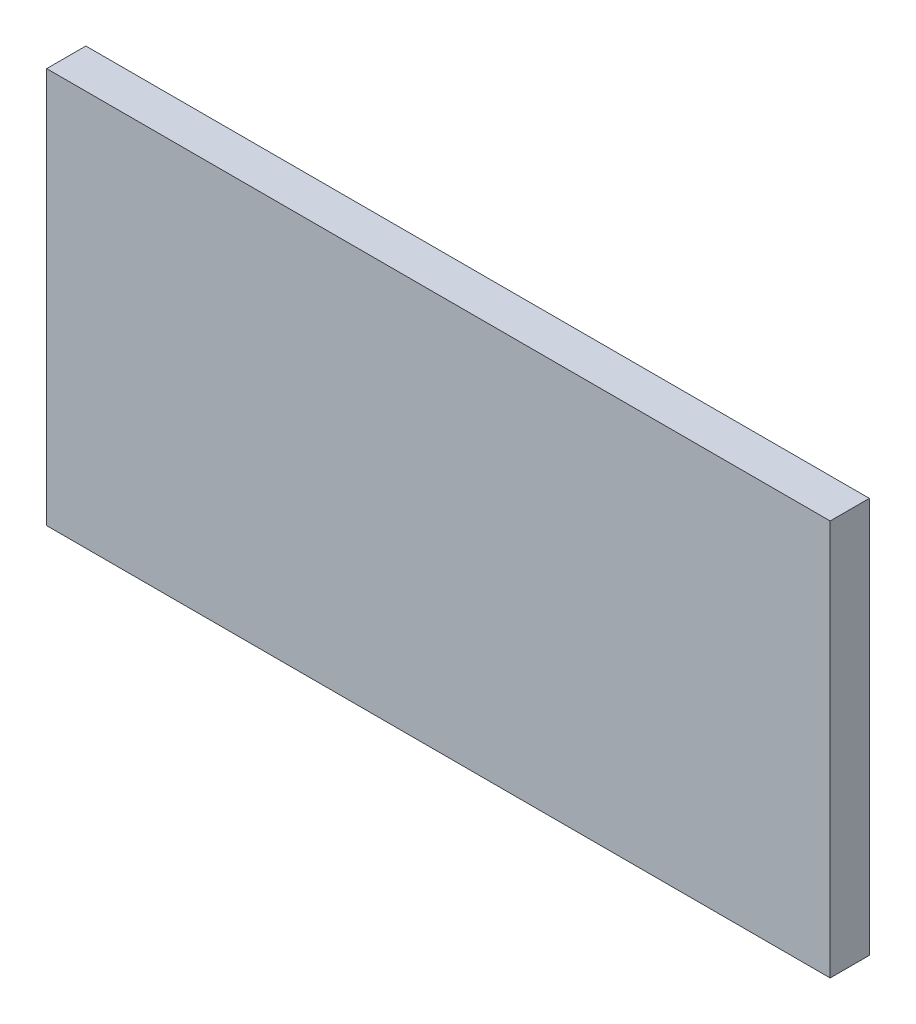
ISO-10303-21;
HEADER;
FILE_DESCRIPTION(('STEP AP214'),'2;1');
FILE_NAME('part.step','',(''),(''),'','','');
FILE_SCHEMA(('AUTOMOTIVE_DESIGN { 1 0 10303 214 1 1 1 1 }'));
ENDSEC;
DATA;
#1=APPLICATION_CONTEXT('core data for automotive mechanical design processes');
#2=APPLICATION_PROTOCOL_DEFINITION('international standard','automotive_design',2000,#1);
#3=PRODUCT_CONTEXT('',#1,'mechanical');
#4=PRODUCT('Part','Part','',(#3));
#5=PRODUCT_RELATED_PRODUCT_CATEGORY('part','',(#4));
#6=PRODUCT_DEFINITION_FORMATION('','',#4);
#7=PRODUCT_DEFINITION_CONTEXT('part definition',#1,'design');
#8=PRODUCT_DEFINITION('design','',#6,#7);
#9=PRODUCT_DEFINITION_SHAPE('','',#8);
#10=(LENGTH_UNIT() NAMED_UNIT(*) SI_UNIT(.MILLI.,.METRE.));
#11=(NAMED_UNIT(*) PLANE_ANGLE_UNIT() SI_UNIT($,.RADIAN.));
#12=(NAMED_UNIT(*) SI_UNIT($,.STERADIAN.) SOLID_ANGLE_UNIT());
#13=UNCERTAINTY_MEASURE_WITH_UNIT(LENGTH_MEASURE(1.E-05),#10,'distance_accuracy_value','');
#14=(GEOMETRIC_REPRESENTATION_CONTEXT(3) GLOBAL_UNCERTAINTY_ASSIGNED_CONTEXT((#13)) GLOBAL_UNIT_ASSIGNED_CONTEXT((#10,
#11,#12)) REPRESENTATION_CONTEXT('',''));
#15=CARTESIAN_POINT('',(0.,0.,0.));
#16=DIRECTION('',(0.,0.,1.));
#17=DIRECTION('',(1.,0.,0.));
#18=AXIS2_PLACEMENT_3D('',#15,#16,#17);
#19=CARTESIAN_POINT('',(-240.,0.,0.));
#20=DIRECTION('',(0.,0.,1.));
#21=DIRECTION('',(0.,-1.,0.));
#22=AXIS2_PLACEMENT_3D('',#19,#20,#21);
#23=PLANE('',#22);
#24=DIRECTION('',(0.,-1.,0.));
#25=VECTOR('',#24,1.);
#26=CARTESIAN_POINT('',(0.,0.,0.));
#27=LINE('',#26,#25);
#28=CARTESIAN_POINT('',(0.,0.,0.));
#29=VERTEX_POINT('',#28);
#30=CARTESIAN_POINT('',(0.,-121.24,0.));
#31=VERTEX_POINT('',#30);
#32=EDGE_CURVE('E97',#29,#31,#27,.T.);
#33=ORIENTED_EDGE('',*,*,#32,.F.);
#34=DIRECTION('',(1.,0.,0.));
#35=VECTOR('',#34,1.);
#36=CARTESIAN_POINT('',(-240.,0.,0.));
#37=LINE('',#36,#35);
#38=CARTESIAN_POINT('',(-240.,0.,0.));
#39=VERTEX_POINT('',#38);
#40=EDGE_CURVE('E11',#39,#29,#37,.T.);
#41=ORIENTED_EDGE('',*,*,#40,.F.);
#42=DIRECTION('',(0.,-1.,0.));
#43=VECTOR('',#42,1.);
#44=CARTESIAN_POINT('',(-240.,0.,0.));
#45=LINE('',#44,#43);
#46=CARTESIAN_POINT('',(-240.,-121.24,0.));
#47=VERTEX_POINT('',#46);
#48=EDGE_CURVE('E91',#39,#47,#45,.T.);
#49=ORIENTED_EDGE('',*,*,#48,.T.);
#50=DIRECTION('',(1.,0.,0.));
#51=VECTOR('',#50,1.);
#52=CARTESIAN_POINT('',(-240.,-121.24,0.));
#53=LINE('',#52,#51);
#54=EDGE_CURVE('E36',#47,#31,#53,.T.);
#55=ORIENTED_EDGE('',*,*,#54,.T.);
#56=EDGE_LOOP('',(#33,#41,#49,#55));
#57=FACE_BOUND('',#56,.T.);
#58=ADVANCED_FACE('F33',(#57),#23,.T.);
#59=CARTESIAN_POINT('',(-240.,0.,0.));
#60=DIRECTION('',(0.,1.,0.));
#61=DIRECTION('',(0.,0.,1.));
#62=AXIS2_PLACEMENT_3D('',#59,#60,#61);
#63=PLANE('',#62);
#64=DIRECTION('',(0.,0.,1.));
#65=VECTOR('',#64,1.);
#66=CARTESIAN_POINT('',(0.,0.,0.));
#67=LINE('',#66,#65);
#68=CARTESIAN_POINT('',(0.,0.,-12.));
#69=VERTEX_POINT('',#68);
#70=EDGE_CURVE('E93',#69,#29,#67,.T.);
#71=ORIENTED_EDGE('',*,*,#70,.F.);
#72=DIRECTION('',(1.,0.,0.));
#73=VECTOR('',#72,1.);
#74=CARTESIAN_POINT('',(-240.,0.,-12.));
#75=LINE('',#74,#73);
#76=CARTESIAN_POINT('',(-240.,0.,-12.));
#77=VERTEX_POINT('',#76);
#78=EDGE_CURVE('E42',#77,#69,#75,.T.);
#79=ORIENTED_EDGE('',*,*,#78,.F.);
#80=DIRECTION('',(0.,0.,1.));
#81=VECTOR('',#80,1.);
#82=CARTESIAN_POINT('',(-240.,0.,0.));
#83=LINE('',#82,#81);
#84=EDGE_CURVE('E88',#77,#39,#83,.T.);
#85=ORIENTED_EDGE('',*,*,#84,.T.);
#86=ORIENTED_EDGE('',*,*,#40,.T.);
#87=EDGE_LOOP('',(#71,#79,#85,#86));
#88=FACE_BOUND('',#87,.T.);
#89=ADVANCED_FACE('F107',(#88),#63,.T.);
#90=CARTESIAN_POINT('',(-240.,0.,-12.));
#91=DIRECTION('',(0.,0.,-1.));
#92=DIRECTION('',(0.,1.,0.));
#93=AXIS2_PLACEMENT_3D('',#90,#91,#92);
#94=PLANE('',#93);
#95=DIRECTION('',(0.,1.,0.));
#96=VECTOR('',#95,1.);
#97=CARTESIAN_POINT('',(0.,0.,-12.));
#98=LINE('',#97,#96);
#99=CARTESIAN_POINT('',(0.,-121.24,-12.));
#100=VERTEX_POINT('',#99);
#101=EDGE_CURVE('E83',#100,#69,#98,.T.);
#102=ORIENTED_EDGE('',*,*,#101,.F.);
#103=DIRECTION('',(1.,0.,0.));
#104=VECTOR('',#103,1.);
#105=CARTESIAN_POINT('',(-240.,-121.24,-12.));
#106=LINE('',#105,#104);
#107=CARTESIAN_POINT('',(-240.,-121.24,-12.));
#108=VERTEX_POINT('',#107);
#109=EDGE_CURVE('E78',#108,#100,#106,.T.);
#110=ORIENTED_EDGE('',*,*,#109,.F.);
#111=DIRECTION('',(0.,1.,0.));
#112=VECTOR('',#111,1.);
#113=CARTESIAN_POINT('',(-240.,0.,-12.));
#114=LINE('',#113,#112);
#115=EDGE_CURVE('E81',#108,#77,#114,.T.);
#116=ORIENTED_EDGE('',*,*,#115,.T.);
#117=ORIENTED_EDGE('',*,*,#78,.T.);
#118=EDGE_LOOP('',(#102,#110,#116,#117));
#119=FACE_BOUND('',#118,.T.);
#120=ADVANCED_FACE('F80',(#119),#94,.T.);
#121=CARTESIAN_POINT('',(-240.,-121.24,0.));
#122=DIRECTION('',(0.,-1.,0.));
#123=DIRECTION('',(0.,0.,-1.));
#124=AXIS2_PLACEMENT_3D('',#121,#122,#123);
#125=PLANE('',#124);
#126=DIRECTION('',(0.,0.,-1.));
#127=VECTOR('',#126,1.);
#128=CARTESIAN_POINT('',(0.,-121.24,0.));
#129=LINE('',#128,#127);
#130=EDGE_CURVE('E100',#31,#100,#129,.T.);
#131=ORIENTED_EDGE('',*,*,#130,.F.);
#132=ORIENTED_EDGE('',*,*,#54,.F.);
#133=DIRECTION('',(0.,0.,-1.));
#134=VECTOR('',#133,1.);
#135=CARTESIAN_POINT('',(-240.,-121.24,0.));
#136=LINE('',#135,#134);
#137=EDGE_CURVE('E87',#47,#108,#136,.T.);
#138=ORIENTED_EDGE('',*,*,#137,.T.);
#139=ORIENTED_EDGE('',*,*,#109,.T.);
#140=EDGE_LOOP('',(#131,#132,#138,#139));
#141=FACE_BOUND('',#140,.T.);
#142=ADVANCED_FACE('F90',(#141),#125,.T.);
#143=CARTESIAN_POINT('',(-240.,0.,0.));
#144=DIRECTION('',(1.,0.,0.));
#145=DIRECTION('',(0.,0.,-1.));
#146=AXIS2_PLACEMENT_3D('',#143,#144,#145);
#147=PLANE('',#146);
#148=ORIENTED_EDGE('',*,*,#48,.F.);
#149=ORIENTED_EDGE('',*,*,#84,.F.);
#150=ORIENTED_EDGE('',*,*,#115,.F.);
#151=ORIENTED_EDGE('',*,*,#137,.F.);
#152=EDGE_LOOP('',(#148,#149,#150,#151));
#153=FACE_BOUND('',#152,.T.);
#154=ADVANCED_FACE('F86',(#153),#147,.F.);
#155=CARTESIAN_POINT('',(0.,0.,0.));
#156=DIRECTION('',(1.,0.,0.));
#157=DIRECTION('',(0.,0.,-1.));
#158=AXIS2_PLACEMENT_3D('',#155,#156,#157);
#159=PLANE('',#158);
#160=ORIENTED_EDGE('',*,*,#32,.T.);
#161=ORIENTED_EDGE('',*,*,#130,.T.);
#162=ORIENTED_EDGE('',*,*,#101,.T.);
#163=ORIENTED_EDGE('',*,*,#70,.T.);
#164=EDGE_LOOP('',(#160,#161,#162,#163));
#165=FACE_BOUND('',#164,.T.);
#166=ADVANCED_FACE('F106',(#165),#159,.T.);
#167=CLOSED_SHELL('',(#58,#89,#120,#142,#154,#166));
#168=MANIFOLD_SOLID_BREP('B2',#167);
#169=ADVANCED_BREP_SHAPE_REPRESENTATION('',(#18,#168),#14);
#170=SHAPE_DEFINITION_REPRESENTATION(#9,#169);
ENDSEC;
END-ISO-10303-21;
